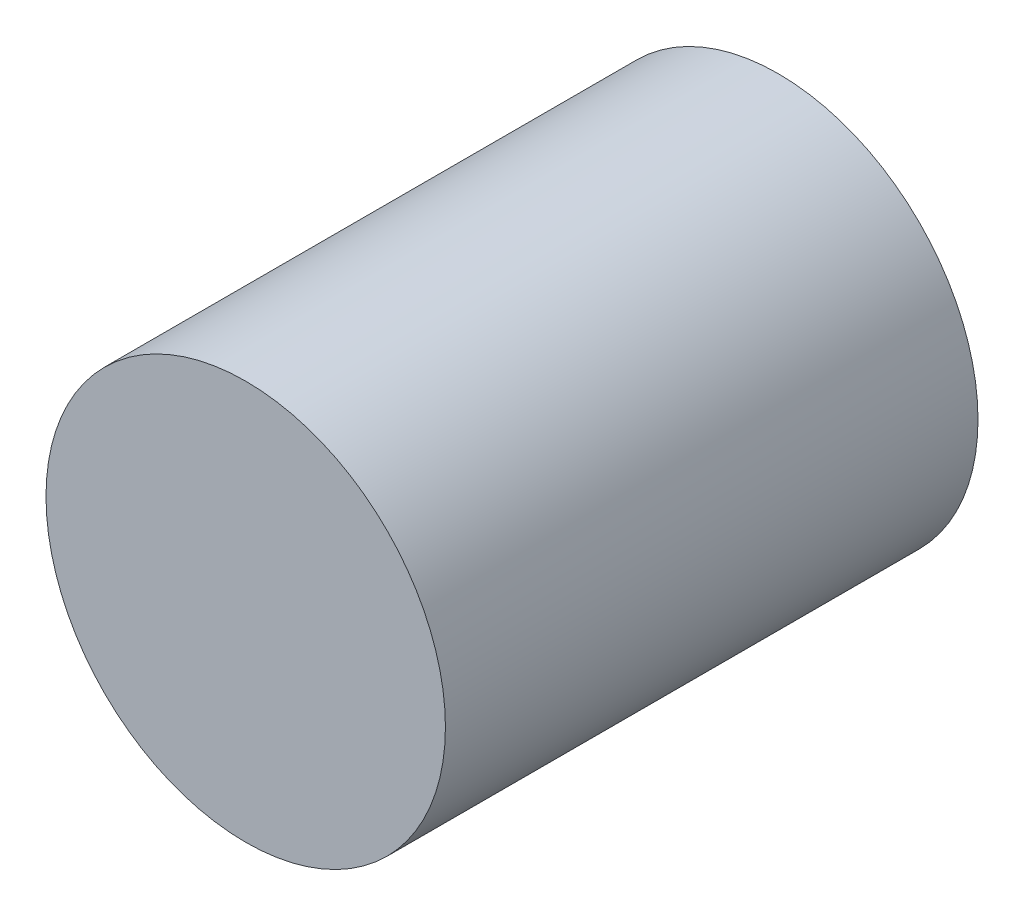
ISO-10303-21;
HEADER;
FILE_DESCRIPTION(('STEP AP214'),'2;1');
FILE_NAME('part.step','',(''),(''),'','','');
FILE_SCHEMA(('AUTOMOTIVE_DESIGN { 1 0 10303 214 1 1 1 1 }'));
ENDSEC;
DATA;
#1=APPLICATION_CONTEXT('core data for automotive mechanical design processes');
#2=APPLICATION_PROTOCOL_DEFINITION('international standard','automotive_design',2000,#1);
#3=PRODUCT_CONTEXT('',#1,'mechanical');
#4=PRODUCT('Part','Part','',(#3));
#5=PRODUCT_RELATED_PRODUCT_CATEGORY('part','',(#4));
#6=PRODUCT_DEFINITION_FORMATION('','',#4);
#7=PRODUCT_DEFINITION_CONTEXT('part definition',#1,'design');
#8=PRODUCT_DEFINITION('design','',#6,#7);
#9=PRODUCT_DEFINITION_SHAPE('','',#8);
#10=(LENGTH_UNIT() NAMED_UNIT(*) SI_UNIT(.MILLI.,.METRE.));
#11=(NAMED_UNIT(*) PLANE_ANGLE_UNIT() SI_UNIT($,.RADIAN.));
#12=(NAMED_UNIT(*) SI_UNIT($,.STERADIAN.) SOLID_ANGLE_UNIT());
#13=UNCERTAINTY_MEASURE_WITH_UNIT(LENGTH_MEASURE(1.E-05),#10,'distance_accuracy_value','');
#14=(GEOMETRIC_REPRESENTATION_CONTEXT(3) GLOBAL_UNCERTAINTY_ASSIGNED_CONTEXT((#13)) GLOBAL_UNIT_ASSIGNED_CONTEXT((#10,
#11,#12)) REPRESENTATION_CONTEXT('',''));
#15=CARTESIAN_POINT('',(0.,0.,0.));
#16=DIRECTION('',(0.,0.,1.));
#17=DIRECTION('',(1.,0.,0.));
#18=AXIS2_PLACEMENT_3D('',#15,#16,#17);
#19=CARTESIAN_POINT('',(0.,38.1,50.8));
#20=DIRECTION('',(0.,0.,-1.));
#21=DIRECTION('',(-1.,0.,0.));
#22=AXIS2_PLACEMENT_3D('',#19,#20,#21);
#23=CYLINDRICAL_SURFACE('',#22,19.05);
#24=CARTESIAN_POINT('',(0.,38.1,50.8));
#25=DIRECTION('',(0.,0.,1.));
#26=DIRECTION('',(1.,0.,0.));
#27=AXIS2_PLACEMENT_3D('',#24,#25,#26);
#28=CIRCLE('',#27,19.05);
#29=CARTESIAN_POINT('',(19.05,38.1,50.8));
#30=VERTEX_POINT('',#29);
#31=EDGE_CURVE('E10',#30,#30,#28,.T.);
#32=ORIENTED_EDGE('',*,*,#31,.F.);
#33=EDGE_LOOP('',(#32));
#34=FACE_BOUND('',#33,.T.);
#35=CARTESIAN_POINT('',(0.,38.1,0.));
#36=DIRECTION('',(0.,0.,1.));
#37=DIRECTION('',(1.,0.,0.));
#38=AXIS2_PLACEMENT_3D('',#35,#36,#37);
#39=CIRCLE('',#38,19.05);
#40=CARTESIAN_POINT('',(19.05,38.1,0.));
#41=VERTEX_POINT('',#40);
#42=EDGE_CURVE('E34',#41,#41,#39,.T.);
#43=ORIENTED_EDGE('',*,*,#42,.T.);
#44=EDGE_LOOP('',(#43));
#45=FACE_BOUND('',#44,.T.);
#46=ADVANCED_FACE('F31',(#34,#45),#23,.T.);
#47=CARTESIAN_POINT('',(0.,38.1,50.8));
#48=DIRECTION('',(0.,0.,1.));
#49=DIRECTION('',(1.,0.,0.));
#50=AXIS2_PLACEMENT_3D('',#47,#48,#49);
#51=PLANE('',#50);
#52=ORIENTED_EDGE('',*,*,#31,.T.);
#53=EDGE_LOOP('',(#52));
#54=FACE_BOUND('',#53,.T.);
#55=ADVANCED_FACE('F46',(#54),#51,.T.);
#56=CARTESIAN_POINT('',(0.,38.1,0.));
#57=DIRECTION('',(0.,0.,1.));
#58=DIRECTION('',(1.,0.,0.));
#59=AXIS2_PLACEMENT_3D('',#56,#57,#58);
#60=PLANE('',#59);
#61=ORIENTED_EDGE('',*,*,#42,.F.);
#62=EDGE_LOOP('',(#61));
#63=FACE_BOUND('',#62,.T.);
#64=ADVANCED_FACE('F44',(#63),#60,.F.);
#65=CLOSED_SHELL('',(#46,#55,#64));
#66=MANIFOLD_SOLID_BREP('B2',#65);
#67=ADVANCED_BREP_SHAPE_REPRESENTATION('',(#18,#66),#14);
#68=SHAPE_DEFINITION_REPRESENTATION(#9,#67);
ENDSEC;
END-ISO-10303-21;
